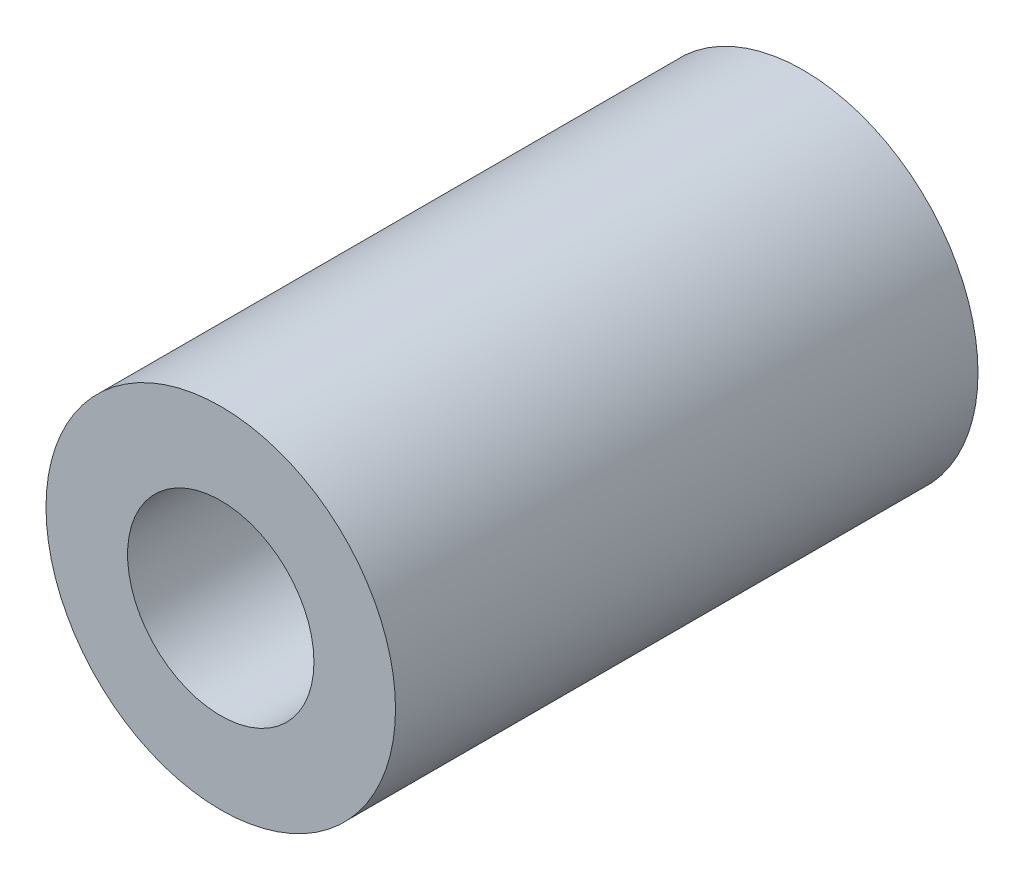
ISO-10303-21;
HEADER;
FILE_DESCRIPTION(('STEP AP214'),'2;1');
FILE_NAME('part.step','',(''),(''),'','','');
FILE_SCHEMA(('AUTOMOTIVE_DESIGN { 1 0 10303 214 1 1 1 1 }'));
ENDSEC;
DATA;
#1=APPLICATION_CONTEXT('core data for automotive mechanical design processes');
#2=APPLICATION_PROTOCOL_DEFINITION('international standard','automotive_design',2000,#1);
#3=PRODUCT_CONTEXT('',#1,'mechanical');
#4=PRODUCT('Part','Part','',(#3));
#5=PRODUCT_RELATED_PRODUCT_CATEGORY('part','',(#4));
#6=PRODUCT_DEFINITION_FORMATION('','',#4);
#7=PRODUCT_DEFINITION_CONTEXT('part definition',#1,'design');
#8=PRODUCT_DEFINITION('design','',#6,#7);
#9=PRODUCT_DEFINITION_SHAPE('','',#8);
#10=(LENGTH_UNIT() NAMED_UNIT(*) SI_UNIT(.MILLI.,.METRE.));
#11=(NAMED_UNIT(*) PLANE_ANGLE_UNIT() SI_UNIT($,.RADIAN.));
#12=(NAMED_UNIT(*) SI_UNIT($,.STERADIAN.) SOLID_ANGLE_UNIT());
#13=UNCERTAINTY_MEASURE_WITH_UNIT(LENGTH_MEASURE(1.E-05),#10,'distance_accuracy_value','');
#14=(GEOMETRIC_REPRESENTATION_CONTEXT(3) GLOBAL_UNCERTAINTY_ASSIGNED_CONTEXT((#13)) GLOBAL_UNIT_ASSIGNED_CONTEXT((#10,
#11,#12)) REPRESENTATION_CONTEXT('',''));
#15=CARTESIAN_POINT('',(0.,0.,0.));
#16=DIRECTION('',(0.,0.,1.));
#17=DIRECTION('',(1.,0.,0.));
#18=AXIS2_PLACEMENT_3D('',#15,#16,#17);
#19=CARTESIAN_POINT('',(0.,0.,10.));
#20=DIRECTION('',(0.,0.,1.));
#21=DIRECTION('',(1.,0.,0.));
#22=AXIS2_PLACEMENT_3D('',#19,#20,#21);
#23=PLANE('',#22);
#24=CARTESIAN_POINT('',(0.,0.,10.));
#25=DIRECTION('',(0.,0.,1.));
#26=DIRECTION('',(1.,0.,0.));
#27=AXIS2_PLACEMENT_3D('',#24,#25,#26);
#28=CIRCLE('',#27,3.);
#29=CARTESIAN_POINT('',(3.,0.,10.));
#30=VERTEX_POINT('',#29);
#31=EDGE_CURVE('E10',#30,#30,#28,.T.);
#32=ORIENTED_EDGE('',*,*,#31,.T.);
#33=EDGE_LOOP('',(#32));
#34=FACE_BOUND('',#33,.T.);
#35=CARTESIAN_POINT('',(0.,0.,10.));
#36=DIRECTION('',(0.,0.,1.));
#37=DIRECTION('',(1.,0.,0.));
#38=AXIS2_PLACEMENT_3D('',#35,#36,#37);
#39=CIRCLE('',#38,1.6);
#40=CARTESIAN_POINT('',(1.6,0.,10.));
#41=VERTEX_POINT('',#40);
#42=EDGE_CURVE('E43',#41,#41,#39,.T.);
#43=ORIENTED_EDGE('',*,*,#42,.F.);
#44=EDGE_LOOP('',(#43));
#45=FACE_BOUND('',#44,.T.);
#46=ADVANCED_FACE('F32',(#34,#45),#23,.T.);
#47=CARTESIAN_POINT('',(0.,0.,0.));
#48=DIRECTION('',(0.,0.,1.));
#49=DIRECTION('',(1.,0.,0.));
#50=AXIS2_PLACEMENT_3D('',#47,#48,#49);
#51=PLANE('',#50);
#52=CARTESIAN_POINT('',(0.,0.,0.));
#53=DIRECTION('',(0.,0.,1.));
#54=DIRECTION('',(1.,0.,0.));
#55=AXIS2_PLACEMENT_3D('',#52,#53,#54);
#56=CIRCLE('',#55,3.);
#57=CARTESIAN_POINT('',(3.,0.,0.));
#58=VERTEX_POINT('',#57);
#59=EDGE_CURVE('E36',#58,#58,#56,.T.);
#60=ORIENTED_EDGE('',*,*,#59,.F.);
#61=EDGE_LOOP('',(#60));
#62=FACE_BOUND('',#61,.T.);
#63=CARTESIAN_POINT('',(0.,0.,0.));
#64=DIRECTION('',(0.,0.,1.));
#65=DIRECTION('',(1.,0.,0.));
#66=AXIS2_PLACEMENT_3D('',#63,#64,#65);
#67=CIRCLE('',#66,1.6);
#68=CARTESIAN_POINT('',(1.6,0.,0.));
#69=VERTEX_POINT('',#68);
#70=EDGE_CURVE('E45',#69,#69,#67,.T.);
#71=ORIENTED_EDGE('',*,*,#70,.T.);
#72=EDGE_LOOP('',(#71));
#73=FACE_BOUND('',#72,.T.);
#74=ADVANCED_FACE('F55',(#62,#73),#51,.F.);
#75=CARTESIAN_POINT('',(0.,0.,10.));
#76=DIRECTION('',(0.,0.,-1.));
#77=DIRECTION('',(-1.,0.,0.));
#78=AXIS2_PLACEMENT_3D('',#75,#76,#77);
#79=CYLINDRICAL_SURFACE('',#78,3.);
#80=ORIENTED_EDGE('',*,*,#31,.F.);
#81=EDGE_LOOP('',(#80));
#82=FACE_BOUND('',#81,.T.);
#83=ORIENTED_EDGE('',*,*,#59,.T.);
#84=EDGE_LOOP('',(#83));
#85=FACE_BOUND('',#84,.T.);
#86=ADVANCED_FACE('F34',(#82,#85),#79,.T.);
#87=CARTESIAN_POINT('',(0.,0.,10.));
#88=DIRECTION('',(0.,0.,-1.));
#89=DIRECTION('',(-1.,0.,0.));
#90=AXIS2_PLACEMENT_3D('',#87,#88,#89);
#91=CYLINDRICAL_SURFACE('',#90,1.6);
#92=ORIENTED_EDGE('',*,*,#42,.T.);
#93=EDGE_LOOP('',(#92));
#94=FACE_BOUND('',#93,.T.);
#95=ORIENTED_EDGE('',*,*,#70,.F.);
#96=EDGE_LOOP('',(#95));
#97=FACE_BOUND('',#96,.T.);
#98=ADVANCED_FACE('F51',(#94,#97),#91,.F.);
#99=CLOSED_SHELL('',(#46,#74,#86,#98));
#100=MANIFOLD_SOLID_BREP('B2',#99);
#101=ADVANCED_BREP_SHAPE_REPRESENTATION('',(#18,#100),#14);
#102=SHAPE_DEFINITION_REPRESENTATION(#9,#101);
ENDSEC;
END-ISO-10303-21;
